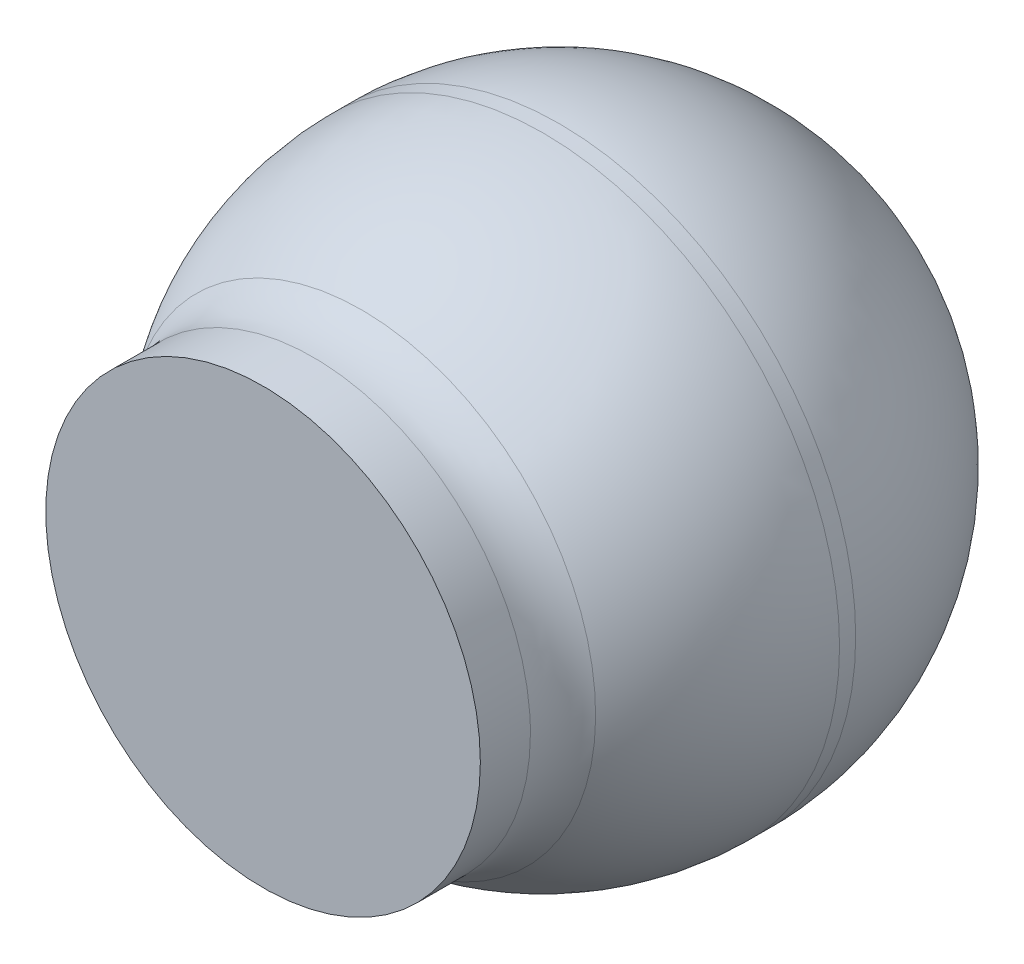
ISO-10303-21;
HEADER;
FILE_DESCRIPTION(('STEP AP214'),'2;1');
FILE_NAME('part.step','',(''),(''),'','','');
FILE_SCHEMA(('AUTOMOTIVE_DESIGN { 1 0 10303 214 1 1 1 1 }'));
ENDSEC;
DATA;
#1=APPLICATION_CONTEXT('core data for automotive mechanical design processes');
#2=APPLICATION_PROTOCOL_DEFINITION('international standard','automotive_design',2000,#1);
#3=PRODUCT_CONTEXT('',#1,'mechanical');
#4=PRODUCT('Part','Part','',(#3));
#5=PRODUCT_RELATED_PRODUCT_CATEGORY('part','',(#4));
#6=PRODUCT_DEFINITION_FORMATION('','',#4);
#7=PRODUCT_DEFINITION_CONTEXT('part definition',#1,'design');
#8=PRODUCT_DEFINITION('design','',#6,#7);
#9=PRODUCT_DEFINITION_SHAPE('','',#8);
#10=(LENGTH_UNIT() NAMED_UNIT(*) SI_UNIT(.MILLI.,.METRE.));
#11=(NAMED_UNIT(*) PLANE_ANGLE_UNIT() SI_UNIT($,.RADIAN.));
#12=(NAMED_UNIT(*) SI_UNIT($,.STERADIAN.) SOLID_ANGLE_UNIT());
#13=UNCERTAINTY_MEASURE_WITH_UNIT(LENGTH_MEASURE(1.E-05),#10,'distance_accuracy_value','');
#14=(GEOMETRIC_REPRESENTATION_CONTEXT(3) GLOBAL_UNCERTAINTY_ASSIGNED_CONTEXT((#13)) GLOBAL_UNIT_ASSIGNED_CONTEXT((#10,
#11,#12)) REPRESENTATION_CONTEXT('',''));
#15=CARTESIAN_POINT('',(0.,0.,0.));
#16=DIRECTION('',(0.,0.,1.));
#17=DIRECTION('',(1.,0.,0.));
#18=AXIS2_PLACEMENT_3D('',#15,#16,#17);
#19=CARTESIAN_POINT('',(-1.832919922269,-9.131349291452,10.006534503384));
#20=DIRECTION('',(0.,0.,-1.));
#21=DIRECTION('',(-1.,0.,0.));
#22=AXIS2_PLACEMENT_3D('',#19,#20,#21);
#23=PLANE('',#22);
#24=CARTESIAN_POINT('',(-1.832919922269,-9.131349291452,10.006534503384));
#25=DIRECTION('',(0.,0.,1.));
#26=DIRECTION('',(1.,0.,0.));
#27=AXIS2_PLACEMENT_3D('',#24,#25,#26);
#28=CIRCLE('',#27,0.275);
#29=CARTESIAN_POINT('',(-1.557919922269,-9.131349291452,10.006534503384));
#30=VERTEX_POINT('',#29);
#31=EDGE_CURVE('E20',#30,#30,#28,.F.);
#32=ORIENTED_EDGE('',*,*,#31,.F.);
#33=EDGE_LOOP('',(#32));
#34=FACE_BOUND('',#33,.T.);
#35=ADVANCED_FACE('F17',(#34),#23,.F.);
#36=CARTESIAN_POINT('',(-1.832919922269,-9.131349291452,9.906534503384));
#37=DIRECTION('',(0.,0.,1.));
#38=DIRECTION('',(1.,0.,0.));
#39=AXIS2_PLACEMENT_3D('',#36,#37,#38);
#40=CYLINDRICAL_SURFACE('',#39,0.275);
#41=CARTESIAN_POINT('',(-1.832919922269,-9.131349291452,9.943180457728));
#42=DIRECTION('',(0.,0.,-1.));
#43=DIRECTION('',(0.996700902337582,0.0811622527992469,0.));
#44=AXIS2_PLACEMENT_3D('',#41,#42,#43);
#45=CIRCLE('',#44,0.275);
#46=CARTESIAN_POINT('',(-1.55882717412616,-9.10902967193221,9.943180457728));
#47=VERTEX_POINT('',#46);
#48=EDGE_CURVE('E65',#47,#47,#45,.F.);
#49=ORIENTED_EDGE('',*,*,#48,.T.);
#50=EDGE_LOOP('',(#49));
#51=FACE_BOUND('',#50,.T.);
#52=ORIENTED_EDGE('',*,*,#31,.T.);
#53=EDGE_LOOP('',(#52));
#54=FACE_BOUND('',#53,.T.);
#55=ADVANCED_FACE('F62',(#51,#54),#40,.T.);
#56=CARTESIAN_POINT('',(-1.832919922269,-9.131349291452,9.943180457728));
#57=DIRECTION('',(0.,0.,-1.));
#58=DIRECTION('',(0.996700902337583,0.0811622527992448,0.));
#59=AXIS2_PLACEMENT_3D('',#56,#57,#58);
#60=TOROIDAL_SURFACE('',#59,0.375,0.1);
#61=ORIENTED_EDGE('',*,*,#48,.F.);
#62=EDGE_LOOP('',(#61));
#63=FACE_BOUND('',#62,.T.);
#64=CARTESIAN_POINT('',(-1.832919922269,-9.131349291452,9.881744931236));
#65=DIRECTION('',(0.,0.,-1.));
#66=DIRECTION('',(-0.996700902337597,-0.0811622527990622,0.));
#67=AXIS2_PLACEMENT_3D('',#64,#65,#66);
#68=CIRCLE('',#67,0.296097046412665);
#69=CARTESIAN_POINT('',(-2.128040115608,-9.155381194786,9.881744931236));
#70=VERTEX_POINT('',#69);
#71=EDGE_CURVE('E39',#70,#70,#68,.T.);
#72=ORIENTED_EDGE('',*,*,#71,.F.);
#73=EDGE_LOOP('',(#72));
#74=FACE_BOUND('',#73,.T.);
#75=ADVANCED_FACE('F57',(#63,#74),#60,.F.);
#76=CARTESIAN_POINT('',(-2.206682760645,-9.161785136252,9.651976062157));
#77=CARTESIAN_POINT('',(-2.206682760645,-9.161785136252,9.701461392103));
#78=CARTESIAN_POINT('',(-2.198526217348,-9.161120941579,9.750947004335));
#79=CARTESIAN_POINT('',(-2.182207085349,-9.159792059952,9.798626332798));
#80=CARTESIAN_POINT('',(-2.158341390838,-9.157848654938,9.842699544317));
#81=CARTESIAN_POINT('',(-2.128040115608,-9.155381194786,9.881744931236));
#82=(BOUNDED_CURVE() B_SPLINE_CURVE(5,(#76,#77,#78,#79,#80,#81),.UNSPECIFIED.,.F.,
.F.) B_SPLINE_CURVE_WITH_KNOTS((6,6),(0.,0.661568582165),
.UNSPECIFIED.) CURVE() GEOMETRIC_REPRESENTATION_ITEM() RATIONAL_B_SPLINE_CURVE((1.,1.,1.,1.,1.,1.)) REPRESENTATION_ITEM(''));
#83=CARTESIAN_POINT('',(-1.832919922269,-9.131349291452,9.651976062157));
#84=DIRECTION('',(0.,0.,-1.));
#85=AXIS1_PLACEMENT('',#83,#84);
#86=SURFACE_OF_REVOLUTION('',#82,#85);
#87=CARTESIAN_POINT('',(-1.832919922269,-9.131349291452,9.651976062157));
#88=DIRECTION('',(0.,0.,1.));
#89=DIRECTION('',(1.,0.,0.));
#90=AXIS2_PLACEMENT_3D('',#87,#88,#89);
#91=CIRCLE('',#90,0.375);
#92=CARTESIAN_POINT('',(-1.457919922269,-9.131349291452,9.651976062157));
#93=VERTEX_POINT('',#92);
#94=EDGE_CURVE('E36',#93,#93,#91,.F.);
#95=ORIENTED_EDGE('',*,*,#94,.F.);
#96=EDGE_LOOP('',(#95));
#97=FACE_BOUND('',#96,.T.);
#98=ORIENTED_EDGE('',*,*,#71,.T.);
#99=EDGE_LOOP('',(#98));
#100=FACE_BOUND('',#99,.T.);
#101=ADVANCED_FACE('F53',(#97,#100),#86,.F.);
#102=CARTESIAN_POINT('',(-1.832919922269,-9.131349291452,9.256534503384));
#103=DIRECTION('',(0.,0.,1.));
#104=DIRECTION('',(1.,0.,0.));
#105=AXIS2_PLACEMENT_3D('',#102,#103,#104);
#106=CYLINDRICAL_SURFACE('',#105,0.375);
#107=CARTESIAN_POINT('',(-1.832919922269,-9.131349291452,9.631534503384));
#108=DIRECTION('',(0.,0.,-1.));
#109=DIRECTION('',(0.0811622527992362,-0.996700902337583,0.));
#110=AXIS2_PLACEMENT_3D('',#107,#108,#109);
#111=CIRCLE('',#110,0.375);
#112=CARTESIAN_POINT('',(-1.80248407746929,-9.50511212982859,9.631534503384));
#113=VERTEX_POINT('',#112);
#114=CARTESIAN_POINT('',(-1.86335576706871,-8.75758645307541,9.631534503384));
#115=VERTEX_POINT('',#114);
#116=EDGE_CURVE('E11',#113,#115,#111,.T.);
#117=ORIENTED_EDGE('',*,*,#116,.F.);
#118=CARTESIAN_POINT('',(-1.832919922269,-9.131349291452,9.631534503384));
#119=DIRECTION('',(0.,0.,1.));
#120=DIRECTION('',(0.0811622527992359,-0.996700902337583,0.));
#121=AXIS2_PLACEMENT_3D('',#118,#119,#120);
#122=CIRCLE('',#121,0.375);
#123=EDGE_CURVE('E25',#115,#113,#122,.F.);
#124=ORIENTED_EDGE('',*,*,#123,.F.);
#125=EDGE_LOOP('',(#117,#124));
#126=FACE_BOUND('',#125,.T.);
#127=ORIENTED_EDGE('',*,*,#94,.T.);
#128=EDGE_LOOP('',(#127));
#129=FACE_BOUND('',#128,.T.);
#130=ADVANCED_FACE('F34',(#126,#129),#106,.T.);
#131=CARTESIAN_POINT('',(-1.832919922269,-9.131349291452,9.631534503384));
#132=DIRECTION('',(0.0811622527992361,-0.996700902337583,0.));
#133=DIRECTION('',(-0.996700902337583,-0.0811622527992361,0.));
#134=AXIS2_PLACEMENT_3D('',#131,#132,#133);
#135=SPHERICAL_SURFACE('',#134,0.375);
#136=ORIENTED_EDGE('',*,*,#123,.T.);
#137=ORIENTED_EDGE('',*,*,#116,.T.);
#138=EDGE_LOOP('',(#136,#137));
#139=FACE_BOUND('',#138,.T.);
#140=ADVANCED_FACE('F32',(#139),#135,.T.);
#141=CLOSED_SHELL('',(#35,#55,#75,#101,#130,#140));
#142=MANIFOLD_SOLID_BREP('B1',#141);
#143=ADVANCED_BREP_SHAPE_REPRESENTATION('',(#18,#142),#14);
#144=SHAPE_DEFINITION_REPRESENTATION(#9,#143);
ENDSEC;
END-ISO-10303-21;
